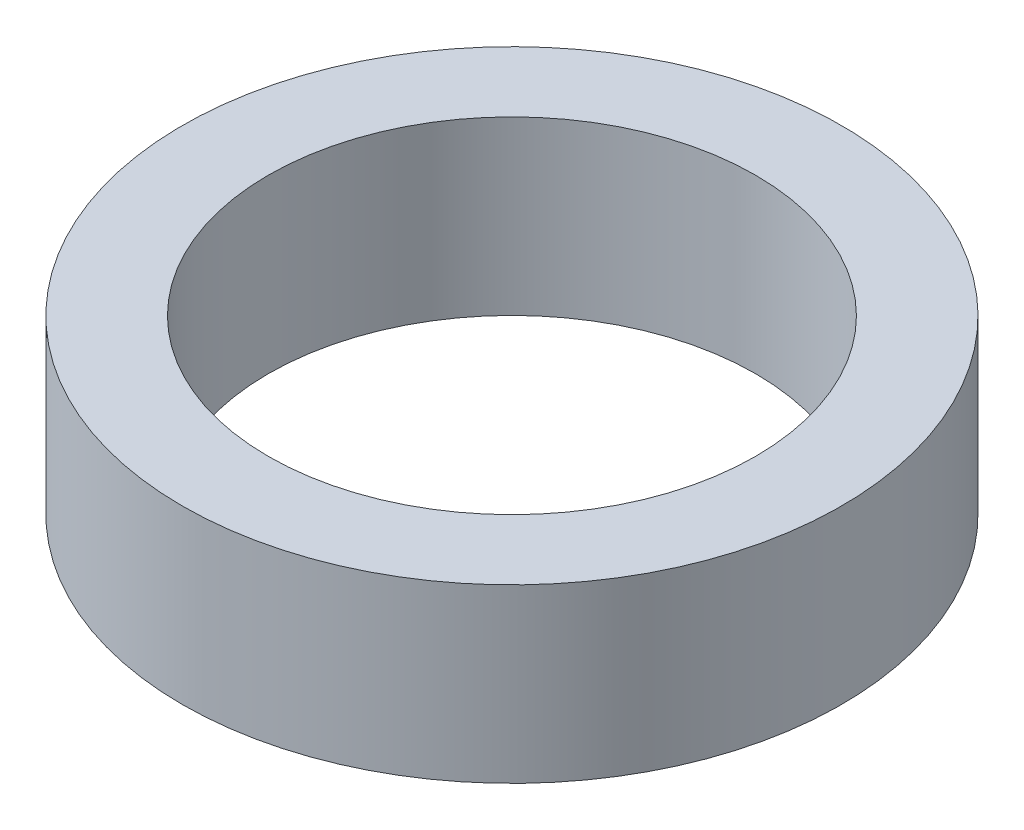
ISO-10303-21;
HEADER;
FILE_DESCRIPTION(('STEP AP214'),'2;1');
FILE_NAME('part.step','',(''),(''),'','','');
FILE_SCHEMA(('AUTOMOTIVE_DESIGN { 1 0 10303 214 1 1 1 1 }'));
ENDSEC;
DATA;
#1=APPLICATION_CONTEXT('core data for automotive mechanical design processes');
#2=APPLICATION_PROTOCOL_DEFINITION('international standard','automotive_design',2000,#1);
#3=PRODUCT_CONTEXT('',#1,'mechanical');
#4=PRODUCT('Part','Part','',(#3));
#5=PRODUCT_RELATED_PRODUCT_CATEGORY('part','',(#4));
#6=PRODUCT_DEFINITION_FORMATION('','',#4);
#7=PRODUCT_DEFINITION_CONTEXT('part definition',#1,'design');
#8=PRODUCT_DEFINITION('design','',#6,#7);
#9=PRODUCT_DEFINITION_SHAPE('','',#8);
#10=(LENGTH_UNIT() NAMED_UNIT(*) SI_UNIT(.MILLI.,.METRE.));
#11=(NAMED_UNIT(*) PLANE_ANGLE_UNIT() SI_UNIT($,.RADIAN.));
#12=(NAMED_UNIT(*) SI_UNIT($,.STERADIAN.) SOLID_ANGLE_UNIT());
#13=UNCERTAINTY_MEASURE_WITH_UNIT(LENGTH_MEASURE(1.E-05),#10,'distance_accuracy_value','');
#14=(GEOMETRIC_REPRESENTATION_CONTEXT(3) GLOBAL_UNCERTAINTY_ASSIGNED_CONTEXT((#13)) GLOBAL_UNIT_ASSIGNED_CONTEXT((#10,
#11,#12)) REPRESENTATION_CONTEXT('',''));
#15=CARTESIAN_POINT('',(0.,0.,0.));
#16=DIRECTION('',(0.,0.,1.));
#17=DIRECTION('',(1.,0.,0.));
#18=AXIS2_PLACEMENT_3D('',#15,#16,#17);
#19=CARTESIAN_POINT('',(0.,30.,0.));
#20=DIRECTION('',(0.,-1.,0.));
#21=DIRECTION('',(0.,0.,-1.));
#22=AXIS2_PLACEMENT_3D('',#19,#20,#21);
#23=CYLINDRICAL_SURFACE('',#22,57.5);
#24=CARTESIAN_POINT('',(0.,30.,0.));
#25=DIRECTION('',(0.,1.,0.));
#26=DIRECTION('',(0.,0.,1.));
#27=AXIS2_PLACEMENT_3D('',#24,#25,#26);
#28=CIRCLE('',#27,57.5);
#29=CARTESIAN_POINT('',(0.,30.,57.5));
#30=VERTEX_POINT('',#29);
#31=EDGE_CURVE('E10',#30,#30,#28,.T.);
#32=ORIENTED_EDGE('',*,*,#31,.F.);
#33=EDGE_LOOP('',(#32));
#34=FACE_BOUND('',#33,.T.);
#35=CARTESIAN_POINT('',(0.,0.,0.));
#36=DIRECTION('',(0.,1.,0.));
#37=DIRECTION('',(0.,0.,1.));
#38=AXIS2_PLACEMENT_3D('',#35,#36,#37);
#39=CIRCLE('',#38,57.5);
#40=CARTESIAN_POINT('',(0.,0.,57.5));
#41=VERTEX_POINT('',#40);
#42=EDGE_CURVE('E37',#41,#41,#39,.T.);
#43=ORIENTED_EDGE('',*,*,#42,.T.);
#44=EDGE_LOOP('',(#43));
#45=FACE_BOUND('',#44,.T.);
#46=ADVANCED_FACE('F40',(#34,#45),#23,.T.);
#47=CARTESIAN_POINT('',(0.,30.,0.));
#48=DIRECTION('',(0.,1.,0.));
#49=DIRECTION('',(0.,0.,1.));
#50=AXIS2_PLACEMENT_3D('',#47,#48,#49);
#51=PLANE('',#50);
#52=CARTESIAN_POINT('',(0.,30.,0.));
#53=DIRECTION('',(0.,1.,0.));
#54=DIRECTION('',(0.,0.,1.));
#55=AXIS2_PLACEMENT_3D('',#52,#53,#54);
#56=CIRCLE('',#55,42.5);
#57=CARTESIAN_POINT('',(0.,30.,42.5));
#58=VERTEX_POINT('',#57);
#59=EDGE_CURVE('E50',#58,#58,#56,.T.);
#60=ORIENTED_EDGE('',*,*,#59,.F.);
#61=EDGE_LOOP('',(#60));
#62=FACE_BOUND('',#61,.T.);
#63=ORIENTED_EDGE('',*,*,#31,.T.);
#64=EDGE_LOOP('',(#63));
#65=FACE_BOUND('',#64,.T.);
#66=ADVANCED_FACE('F59',(#62,#65),#51,.T.);
#67=CARTESIAN_POINT('',(0.,0.,0.));
#68=DIRECTION('',(0.,1.,0.));
#69=DIRECTION('',(0.,0.,1.));
#70=AXIS2_PLACEMENT_3D('',#67,#68,#69);
#71=PLANE('',#70);
#72=CARTESIAN_POINT('',(0.,0.,0.));
#73=DIRECTION('',(0.,1.,0.));
#74=DIRECTION('',(0.,0.,1.));
#75=AXIS2_PLACEMENT_3D('',#72,#73,#74);
#76=CIRCLE('',#75,42.5);
#77=CARTESIAN_POINT('',(0.,0.,42.5));
#78=VERTEX_POINT('',#77);
#79=EDGE_CURVE('E47',#78,#78,#76,.T.);
#80=ORIENTED_EDGE('',*,*,#79,.T.);
#81=EDGE_LOOP('',(#80));
#82=FACE_BOUND('',#81,.T.);
#83=ORIENTED_EDGE('',*,*,#42,.F.);
#84=EDGE_LOOP('',(#83));
#85=FACE_BOUND('',#84,.T.);
#86=ADVANCED_FACE('F58',(#82,#85),#71,.F.);
#87=CARTESIAN_POINT('',(0.,30.,0.));
#88=DIRECTION('',(0.,-1.,0.));
#89=DIRECTION('',(0.,0.,-1.));
#90=AXIS2_PLACEMENT_3D('',#87,#88,#89);
#91=CYLINDRICAL_SURFACE('',#90,42.5);
#92=ORIENTED_EDGE('',*,*,#59,.T.);
#93=EDGE_LOOP('',(#92));
#94=FACE_BOUND('',#93,.T.);
#95=ORIENTED_EDGE('',*,*,#79,.F.);
#96=EDGE_LOOP('',(#95));
#97=FACE_BOUND('',#96,.T.);
#98=ADVANCED_FACE('F54',(#94,#97),#91,.F.);
#99=CLOSED_SHELL('',(#46,#66,#86,#98));
#100=MANIFOLD_SOLID_BREP('B2',#99);
#101=ADVANCED_BREP_SHAPE_REPRESENTATION('',(#18,#100),#14);
#102=SHAPE_DEFINITION_REPRESENTATION(#9,#101);
ENDSEC;
END-ISO-10303-21;
